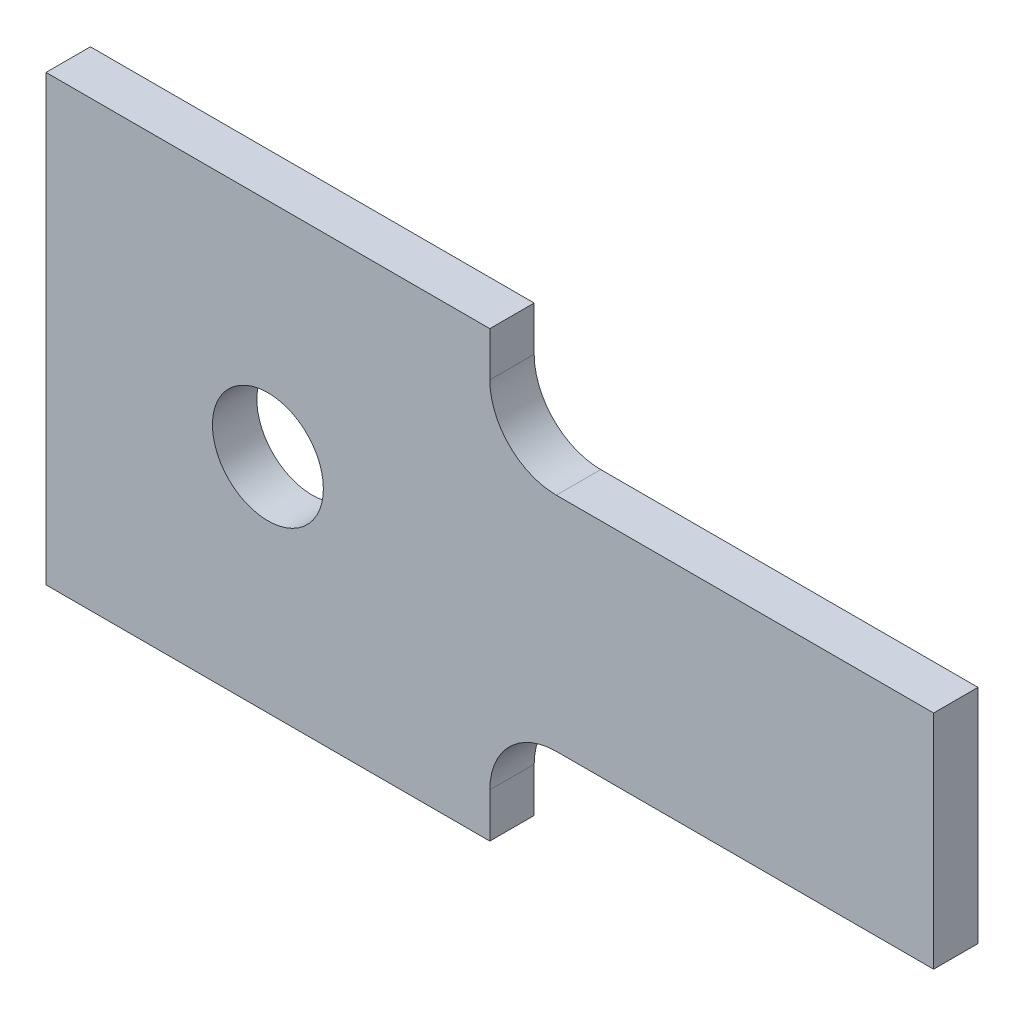
ISO-10303-21;
HEADER;
FILE_DESCRIPTION(('STEP AP214'),'2;1');
FILE_NAME('part.step','',(''),(''),'','','');
FILE_SCHEMA(('AUTOMOTIVE_DESIGN { 1 0 10303 214 1 1 1 1 }'));
ENDSEC;
DATA;
#1=APPLICATION_CONTEXT('core data for automotive mechanical design processes');
#2=APPLICATION_PROTOCOL_DEFINITION('international standard','automotive_design',2000,#1);
#3=PRODUCT_CONTEXT('',#1,'mechanical');
#4=PRODUCT('Part','Part','',(#3));
#5=PRODUCT_RELATED_PRODUCT_CATEGORY('part','',(#4));
#6=PRODUCT_DEFINITION_FORMATION('','',#4);
#7=PRODUCT_DEFINITION_CONTEXT('part definition',#1,'design');
#8=PRODUCT_DEFINITION('design','',#6,#7);
#9=PRODUCT_DEFINITION_SHAPE('','',#8);
#10=(LENGTH_UNIT() NAMED_UNIT(*) SI_UNIT(.MILLI.,.METRE.));
#11=(NAMED_UNIT(*) PLANE_ANGLE_UNIT() SI_UNIT($,.RADIAN.));
#12=(NAMED_UNIT(*) SI_UNIT($,.STERADIAN.) SOLID_ANGLE_UNIT());
#13=UNCERTAINTY_MEASURE_WITH_UNIT(LENGTH_MEASURE(1.E-05),#10,'distance_accuracy_value','');
#14=(GEOMETRIC_REPRESENTATION_CONTEXT(3) GLOBAL_UNCERTAINTY_ASSIGNED_CONTEXT((#13)) GLOBAL_UNIT_ASSIGNED_CONTEXT((#10,
#11,#12)) REPRESENTATION_CONTEXT('',''));
#15=CARTESIAN_POINT('',(0.,0.,0.));
#16=DIRECTION('',(0.,0.,1.));
#17=DIRECTION('',(1.,0.,0.));
#18=AXIS2_PLACEMENT_3D('',#15,#16,#17);
#19=CARTESIAN_POINT('',(0.,50.,10.));
#20=DIRECTION('',(1.,0.,0.));
#21=DIRECTION('',(0.,0.,-1.));
#22=AXIS2_PLACEMENT_3D('',#19,#20,#21);
#23=PLANE('',#22);
#24=DIRECTION('',(0.,-1.,0.));
#25=VECTOR('',#24,1.);
#26=CARTESIAN_POINT('',(0.,50.,5.));
#27=LINE('',#26,#25);
#28=CARTESIAN_POINT('',(0.,0.,5.));
#29=VERTEX_POINT('',#28);
#30=CARTESIAN_POINT('',(0.,-50.,5.));
#31=VERTEX_POINT('',#30);
#32=EDGE_CURVE('E11',#29,#31,#27,.T.);
#33=ORIENTED_EDGE('',*,*,#32,.F.);
#34=DIRECTION('',(0.,0.,1.));
#35=VECTOR('',#34,1.);
#36=CARTESIAN_POINT('',(0.,0.,10.));
#37=LINE('',#36,#35);
#38=CARTESIAN_POINT('',(0.,0.,0.));
#39=VERTEX_POINT('',#38);
#40=EDGE_CURVE('E157',#39,#29,#37,.T.);
#41=ORIENTED_EDGE('',*,*,#40,.F.);
#42=DIRECTION('',(0.,-1.,0.));
#43=VECTOR('',#42,1.);
#44=CARTESIAN_POINT('',(0.,50.,0.));
#45=LINE('',#44,#43);
#46=CARTESIAN_POINT('',(0.,-50.,0.));
#47=VERTEX_POINT('',#46);
#48=EDGE_CURVE('E191',#39,#47,#45,.T.);
#49=ORIENTED_EDGE('',*,*,#48,.T.);
#50=DIRECTION('',(0.,0.,-1.));
#51=VECTOR('',#50,1.);
#52=CARTESIAN_POINT('',(0.,-50.,10.));
#53=LINE('',#52,#51);
#54=EDGE_CURVE('E230',#31,#47,#53,.T.);
#55=ORIENTED_EDGE('',*,*,#54,.F.);
#56=EDGE_LOOP('',(#33,#41,#49,#55));
#57=FACE_BOUND('',#56,.T.);
#58=ADVANCED_FACE('F40',(#57),#23,.F.);
#59=DIRECTION('',(0.,-1.,0.));
#60=VECTOR('',#59,1.);
#61=CARTESIAN_POINT('',(0.,50.,5.));
#62=LINE('',#61,#60);
#63=CARTESIAN_POINT('',(0.,50.,5.));
#64=VERTEX_POINT('',#63);
#65=EDGE_CURVE('E44',#64,#29,#62,.T.);
#66=ORIENTED_EDGE('',*,*,#65,.F.);
#67=DIRECTION('',(0.,0.,-1.));
#68=VECTOR('',#67,1.);
#69=CARTESIAN_POINT('',(0.,50.,10.));
#70=LINE('',#69,#68);
#71=CARTESIAN_POINT('',(0.,50.,0.));
#72=VERTEX_POINT('',#71);
#73=EDGE_CURVE('E154',#64,#72,#70,.T.);
#74=ORIENTED_EDGE('',*,*,#73,.T.);
#75=EDGE_CURVE('E193',#72,#39,#45,.T.);
#76=ORIENTED_EDGE('',*,*,#75,.T.);
#77=ORIENTED_EDGE('',*,*,#40,.T.);
#78=EDGE_LOOP('',(#66,#74,#76,#77));
#79=FACE_BOUND('',#78,.T.);
#80=ADVANCED_FACE('F274',(#79),#23,.F.);
#81=CARTESIAN_POINT('',(0.,0.,10.));
#82=VERTEX_POINT('',#81);
#83=EDGE_CURVE('E137',#29,#82,#37,.T.);
#84=ORIENTED_EDGE('',*,*,#83,.F.);
#85=ORIENTED_EDGE('',*,*,#32,.T.);
#86=CARTESIAN_POINT('',(0.,-50.,10.));
#87=VERTEX_POINT('',#86);
#88=EDGE_CURVE('E159',#87,#31,#53,.T.);
#89=ORIENTED_EDGE('',*,*,#88,.F.);
#90=DIRECTION('',(0.,-1.,0.));
#91=VECTOR('',#90,1.);
#92=CARTESIAN_POINT('',(0.,50.,10.));
#93=LINE('',#92,#91);
#94=EDGE_CURVE('E141',#82,#87,#93,.T.);
#95=ORIENTED_EDGE('',*,*,#94,.F.);
#96=EDGE_LOOP('',(#84,#85,#89,#95));
#97=FACE_BOUND('',#96,.T.);
#98=ADVANCED_FACE('F169',(#97),#23,.F.);
#99=CARTESIAN_POINT('',(100.,50.,10.));
#100=DIRECTION('',(0.,-1.,0.));
#101=DIRECTION('',(1.,0.,0.));
#102=AXIS2_PLACEMENT_3D('',#99,#100,#101);
#103=PLANE('',#102);
#104=DIRECTION('',(-1.,0.,0.));
#105=VECTOR('',#104,1.);
#106=CARTESIAN_POINT('',(100.,50.,0.));
#107=LINE('',#106,#105);
#108=CARTESIAN_POINT('',(100.,50.,0.));
#109=VERTEX_POINT('',#108);
#110=EDGE_CURVE('E189',#109,#72,#107,.T.);
#111=ORIENTED_EDGE('',*,*,#110,.T.);
#112=ORIENTED_EDGE('',*,*,#73,.F.);
#113=CARTESIAN_POINT('',(0.,50.,10.));
#114=VERTEX_POINT('',#113);
#115=EDGE_CURVE('E136',#114,#64,#70,.T.);
#116=ORIENTED_EDGE('',*,*,#115,.F.);
#117=DIRECTION('',(-1.,0.,0.));
#118=VECTOR('',#117,1.);
#119=CARTESIAN_POINT('',(100.,50.,10.));
#120=LINE('',#119,#118);
#121=CARTESIAN_POINT('',(100.,50.,10.));
#122=VERTEX_POINT('',#121);
#123=EDGE_CURVE('E144',#122,#114,#120,.T.);
#124=ORIENTED_EDGE('',*,*,#123,.F.);
#125=DIRECTION('',(0.,0.,-1.));
#126=VECTOR('',#125,1.);
#127=CARTESIAN_POINT('',(100.,50.,10.));
#128=LINE('',#127,#126);
#129=EDGE_CURVE('E188',#122,#109,#128,.T.);
#130=ORIENTED_EDGE('',*,*,#129,.T.);
#131=EDGE_LOOP('',(#111,#112,#116,#124,#130));
#132=FACE_BOUND('',#131,.T.);
#133=ADVANCED_FACE('F42',(#132),#103,.F.);
#134=ORIENTED_EDGE('',*,*,#115,.T.);
#135=ORIENTED_EDGE('',*,*,#65,.T.);
#136=ORIENTED_EDGE('',*,*,#83,.T.);
#137=EDGE_CURVE('E132',#114,#82,#93,.T.);
#138=ORIENTED_EDGE('',*,*,#137,.F.);
#139=EDGE_LOOP('',(#134,#135,#136,#138));
#140=FACE_BOUND('',#139,.T.);
#141=ADVANCED_FACE('F134',(#140),#23,.F.);
#142=CARTESIAN_POINT('',(100.,-50.,10.));
#143=DIRECTION('',(0.,1.,0.));
#144=DIRECTION('',(-1.,0.,0.));
#145=AXIS2_PLACEMENT_3D('',#142,#143,#144);
#146=PLANE('',#145);
#147=DIRECTION('',(1.,0.,0.));
#148=VECTOR('',#147,1.);
#149=CARTESIAN_POINT('',(100.,-50.,0.));
#150=LINE('',#149,#148);
#151=CARTESIAN_POINT('',(100.,-50.,0.));
#152=VERTEX_POINT('',#151);
#153=EDGE_CURVE('E195',#47,#152,#150,.T.);
#154=ORIENTED_EDGE('',*,*,#153,.T.);
#155=DIRECTION('',(0.,0.,-1.));
#156=VECTOR('',#155,1.);
#157=CARTESIAN_POINT('',(100.,-50.,10.));
#158=LINE('',#157,#156);
#159=CARTESIAN_POINT('',(100.,-50.,10.));
#160=VERTEX_POINT('',#159);
#161=EDGE_CURVE('E228',#160,#152,#158,.T.);
#162=ORIENTED_EDGE('',*,*,#161,.F.);
#163=DIRECTION('',(1.,0.,0.));
#164=VECTOR('',#163,1.);
#165=CARTESIAN_POINT('',(100.,-50.,10.));
#166=LINE('',#165,#164);
#167=EDGE_CURVE('E140',#87,#160,#166,.T.);
#168=ORIENTED_EDGE('',*,*,#167,.F.);
#169=ORIENTED_EDGE('',*,*,#88,.T.);
#170=ORIENTED_EDGE('',*,*,#54,.T.);
#171=EDGE_LOOP('',(#154,#162,#168,#169,#170));
#172=FACE_BOUND('',#171,.T.);
#173=ADVANCED_FACE('F237',(#172),#146,.F.);
#174=CARTESIAN_POINT('',(100.,-40.0000000000001,10.));
#175=DIRECTION('',(-1.,0.,0.));
#176=DIRECTION('',(0.,0.,1.));
#177=AXIS2_PLACEMENT_3D('',#174,#175,#176);
#178=PLANE('',#177);
#179=DIRECTION('',(0.,1.,0.));
#180=VECTOR('',#179,1.);
#181=CARTESIAN_POINT('',(100.,-40.0000000000001,0.));
#182=LINE('',#181,#180);
#183=CARTESIAN_POINT('',(100.,-40.0000000000001,0.));
#184=VERTEX_POINT('',#183);
#185=EDGE_CURVE('E197',#152,#184,#182,.T.);
#186=ORIENTED_EDGE('',*,*,#185,.T.);
#187=DIRECTION('',(0.,0.,-1.));
#188=VECTOR('',#187,1.);
#189=CARTESIAN_POINT('',(100.,-40.0000000000001,10.));
#190=LINE('',#189,#188);
#191=CARTESIAN_POINT('',(100.,-40.0000000000001,10.));
#192=VERTEX_POINT('',#191);
#193=EDGE_CURVE('E226',#192,#184,#190,.T.);
#194=ORIENTED_EDGE('',*,*,#193,.F.);
#195=DIRECTION('',(0.,1.,0.));
#196=VECTOR('',#195,1.);
#197=CARTESIAN_POINT('',(100.,-40.0000000000001,10.));
#198=LINE('',#197,#196);
#199=EDGE_CURVE('E175',#160,#192,#198,.T.);
#200=ORIENTED_EDGE('',*,*,#199,.F.);
#201=ORIENTED_EDGE('',*,*,#161,.T.);
#202=EDGE_LOOP('',(#186,#194,#200,#201));
#203=FACE_BOUND('',#202,.T.);
#204=ADVANCED_FACE('F241',(#203),#178,.F.);
#205=CARTESIAN_POINT('',(115.,-40.,10.));
#206=DIRECTION('',(0.,0.,-1.));
#207=DIRECTION('',(-1.,0.,0.));
#208=AXIS2_PLACEMENT_3D('',#205,#206,#207);
#209=CYLINDRICAL_SURFACE('',#208,15.);
#210=CARTESIAN_POINT('',(115.,-40.,0.));
#211=DIRECTION('',(0.,0.,-1.));
#212=DIRECTION('',(1.,0.,0.));
#213=AXIS2_PLACEMENT_3D('',#210,#211,#212);
#214=CIRCLE('',#213,15.);
#215=CARTESIAN_POINT('',(115.,-25.,0.));
#216=VERTEX_POINT('',#215);
#217=EDGE_CURVE('E199',#184,#216,#214,.T.);
#218=ORIENTED_EDGE('',*,*,#217,.T.);
#219=DIRECTION('',(0.,0.,-1.));
#220=VECTOR('',#219,1.);
#221=CARTESIAN_POINT('',(115.,-25.,10.));
#222=LINE('',#221,#220);
#223=CARTESIAN_POINT('',(115.,-25.,10.));
#224=VERTEX_POINT('',#223);
#225=EDGE_CURVE('E223',#224,#216,#222,.T.);
#226=ORIENTED_EDGE('',*,*,#225,.F.);
#227=CARTESIAN_POINT('',(115.,-40.,10.));
#228=DIRECTION('',(0.,0.,-1.));
#229=DIRECTION('',(1.,0.,0.));
#230=AXIS2_PLACEMENT_3D('',#227,#228,#229);
#231=CIRCLE('',#230,15.);
#232=EDGE_CURVE('E177',#192,#224,#231,.T.);
#233=ORIENTED_EDGE('',*,*,#232,.F.);
#234=ORIENTED_EDGE('',*,*,#193,.T.);
#235=EDGE_LOOP('',(#218,#226,#233,#234));
#236=FACE_BOUND('',#235,.T.);
#237=ADVANCED_FACE('F244',(#236),#209,.F.);
#238=CARTESIAN_POINT('',(200.,-25.,10.));
#239=DIRECTION('',(0.,1.,0.));
#240=DIRECTION('',(-1.,0.,0.));
#241=AXIS2_PLACEMENT_3D('',#238,#239,#240);
#242=PLANE('',#241);
#243=DIRECTION('',(1.,0.,0.));
#244=VECTOR('',#243,1.);
#245=CARTESIAN_POINT('',(200.,-25.,0.));
#246=LINE('',#245,#244);
#247=CARTESIAN_POINT('',(200.,-25.,0.));
#248=VERTEX_POINT('',#247);
#249=EDGE_CURVE('E201',#216,#248,#246,.T.);
#250=ORIENTED_EDGE('',*,*,#249,.T.);
#251=DIRECTION('',(0.,0.,-1.));
#252=VECTOR('',#251,1.);
#253=CARTESIAN_POINT('',(200.,-25.,10.));
#254=LINE('',#253,#252);
#255=CARTESIAN_POINT('',(200.,-25.,10.));
#256=VERTEX_POINT('',#255);
#257=EDGE_CURVE('E220',#256,#248,#254,.T.);
#258=ORIENTED_EDGE('',*,*,#257,.F.);
#259=DIRECTION('',(1.,0.,0.));
#260=VECTOR('',#259,1.);
#261=CARTESIAN_POINT('',(200.,-25.,10.));
#262=LINE('',#261,#260);
#263=EDGE_CURVE('E179',#224,#256,#262,.T.);
#264=ORIENTED_EDGE('',*,*,#263,.F.);
#265=ORIENTED_EDGE('',*,*,#225,.T.);
#266=EDGE_LOOP('',(#250,#258,#264,#265));
#267=FACE_BOUND('',#266,.T.);
#268=ADVANCED_FACE('F249',(#267),#242,.F.);
#269=CARTESIAN_POINT('',(200.,-25.,10.));
#270=DIRECTION('',(-1.,0.,0.));
#271=DIRECTION('',(0.,0.,1.));
#272=AXIS2_PLACEMENT_3D('',#269,#270,#271);
#273=PLANE('',#272);
#274=DIRECTION('',(0.,1.,0.));
#275=VECTOR('',#274,1.);
#276=CARTESIAN_POINT('',(200.,-25.,0.));
#277=LINE('',#276,#275);
#278=CARTESIAN_POINT('',(200.,25.,0.));
#279=VERTEX_POINT('',#278);
#280=EDGE_CURVE('E203',#248,#279,#277,.T.);
#281=ORIENTED_EDGE('',*,*,#280,.T.);
#282=DIRECTION('',(0.,0.,-1.));
#283=VECTOR('',#282,1.);
#284=CARTESIAN_POINT('',(200.,25.,10.));
#285=LINE('',#284,#283);
#286=CARTESIAN_POINT('',(200.,25.,10.));
#287=VERTEX_POINT('',#286);
#288=EDGE_CURVE('E217',#287,#279,#285,.T.);
#289=ORIENTED_EDGE('',*,*,#288,.F.);
#290=DIRECTION('',(0.,1.,0.));
#291=VECTOR('',#290,1.);
#292=CARTESIAN_POINT('',(200.,-25.,10.));
#293=LINE('',#292,#291);
#294=EDGE_CURVE('E181',#256,#287,#293,.T.);
#295=ORIENTED_EDGE('',*,*,#294,.F.);
#296=ORIENTED_EDGE('',*,*,#257,.T.);
#297=EDGE_LOOP('',(#281,#289,#295,#296));
#298=FACE_BOUND('',#297,.T.);
#299=ADVANCED_FACE('F255',(#298),#273,.F.);
#300=CARTESIAN_POINT('',(200.,25.,10.));
#301=DIRECTION('',(0.,-1.,0.));
#302=DIRECTION('',(1.,0.,0.));
#303=AXIS2_PLACEMENT_3D('',#300,#301,#302);
#304=PLANE('',#303);
#305=DIRECTION('',(-1.,0.,0.));
#306=VECTOR('',#305,1.);
#307=CARTESIAN_POINT('',(200.,25.,0.));
#308=LINE('',#307,#306);
#309=CARTESIAN_POINT('',(115.,25.,0.));
#310=VERTEX_POINT('',#309);
#311=EDGE_CURVE('E205',#279,#310,#308,.T.);
#312=ORIENTED_EDGE('',*,*,#311,.T.);
#313=DIRECTION('',(0.,0.,-1.));
#314=VECTOR('',#313,1.);
#315=CARTESIAN_POINT('',(115.,25.,10.));
#316=LINE('',#315,#314);
#317=CARTESIAN_POINT('',(115.,25.,10.));
#318=VERTEX_POINT('',#317);
#319=EDGE_CURVE('E214',#318,#310,#316,.T.);
#320=ORIENTED_EDGE('',*,*,#319,.F.);
#321=DIRECTION('',(-1.,0.,0.));
#322=VECTOR('',#321,1.);
#323=CARTESIAN_POINT('',(200.,25.,10.));
#324=LINE('',#323,#322);
#325=EDGE_CURVE('E183',#287,#318,#324,.T.);
#326=ORIENTED_EDGE('',*,*,#325,.F.);
#327=ORIENTED_EDGE('',*,*,#288,.T.);
#328=EDGE_LOOP('',(#312,#320,#326,#327));
#329=FACE_BOUND('',#328,.T.);
#330=ADVANCED_FACE('F259',(#329),#304,.F.);
#331=CARTESIAN_POINT('',(115.,40.,10.));
#332=DIRECTION('',(0.,0.,-1.));
#333=DIRECTION('',(-1.,0.,0.));
#334=AXIS2_PLACEMENT_3D('',#331,#332,#333);
#335=CYLINDRICAL_SURFACE('',#334,15.);
#336=CARTESIAN_POINT('',(115.,40.,0.));
#337=DIRECTION('',(0.,0.,-1.));
#338=DIRECTION('',(-1.,0.,0.));
#339=AXIS2_PLACEMENT_3D('',#336,#337,#338);
#340=CIRCLE('',#339,15.);
#341=CARTESIAN_POINT('',(100.,40.0000000000001,0.));
#342=VERTEX_POINT('',#341);
#343=EDGE_CURVE('E207',#310,#342,#340,.T.);
#344=ORIENTED_EDGE('',*,*,#343,.T.);
#345=DIRECTION('',(0.,0.,-1.));
#346=VECTOR('',#345,1.);
#347=CARTESIAN_POINT('',(100.,40.0000000000001,10.));
#348=LINE('',#347,#346);
#349=CARTESIAN_POINT('',(100.,40.0000000000001,10.));
#350=VERTEX_POINT('',#349);
#351=EDGE_CURVE('E211',#350,#342,#348,.T.);
#352=ORIENTED_EDGE('',*,*,#351,.F.);
#353=CARTESIAN_POINT('',(115.,40.,10.));
#354=DIRECTION('',(0.,0.,-1.));
#355=DIRECTION('',(-1.,0.,0.));
#356=AXIS2_PLACEMENT_3D('',#353,#354,#355);
#357=CIRCLE('',#356,15.);
#358=EDGE_CURVE('E185',#318,#350,#357,.T.);
#359=ORIENTED_EDGE('',*,*,#358,.F.);
#360=ORIENTED_EDGE('',*,*,#319,.T.);
#361=EDGE_LOOP('',(#344,#352,#359,#360));
#362=FACE_BOUND('',#361,.T.);
#363=ADVANCED_FACE('F264',(#362),#335,.F.);
#364=CARTESIAN_POINT('',(100.,40.0000000000001,10.));
#365=DIRECTION('',(-1.,0.,0.));
#366=DIRECTION('',(0.,0.,1.));
#367=AXIS2_PLACEMENT_3D('',#364,#365,#366);
#368=PLANE('',#367);
#369=DIRECTION('',(0.,1.,0.));
#370=VECTOR('',#369,1.);
#371=CARTESIAN_POINT('',(100.,40.0000000000001,0.));
#372=LINE('',#371,#370);
#373=EDGE_CURVE('E151',#342,#109,#372,.T.);
#374=ORIENTED_EDGE('',*,*,#373,.T.);
#375=ORIENTED_EDGE('',*,*,#129,.F.);
#376=DIRECTION('',(0.,1.,0.));
#377=VECTOR('',#376,1.);
#378=CARTESIAN_POINT('',(100.,40.0000000000001,10.));
#379=LINE('',#378,#377);
#380=EDGE_CURVE('E147',#350,#122,#379,.T.);
#381=ORIENTED_EDGE('',*,*,#380,.F.);
#382=ORIENTED_EDGE('',*,*,#351,.T.);
#383=EDGE_LOOP('',(#374,#375,#381,#382));
#384=FACE_BOUND('',#383,.T.);
#385=ADVANCED_FACE('F267',(#384),#368,.F.);
#386=CARTESIAN_POINT('',(115.,-40.,10.));
#387=DIRECTION('',(0.,0.,1.));
#388=DIRECTION('',(1.,0.,0.));
#389=AXIS2_PLACEMENT_3D('',#386,#387,#388);
#390=PLANE('',#389);
#391=CARTESIAN_POINT('',(50.,0.,10.));
#392=DIRECTION('',(0.,0.,1.));
#393=DIRECTION('',(1.,0.,0.));
#394=AXIS2_PLACEMENT_3D('',#391,#392,#393);
#395=CIRCLE('',#394,12.5);
#396=CARTESIAN_POINT('',(62.5,0.,10.));
#397=VERTEX_POINT('',#396);
#398=EDGE_CURVE('E315',#397,#397,#395,.T.);
#399=ORIENTED_EDGE('',*,*,#398,.F.);
#400=EDGE_LOOP('',(#399));
#401=FACE_BOUND('',#400,.T.);
#402=ORIENTED_EDGE('',*,*,#123,.T.);
#403=ORIENTED_EDGE('',*,*,#137,.T.);
#404=ORIENTED_EDGE('',*,*,#94,.T.);
#405=ORIENTED_EDGE('',*,*,#167,.T.);
#406=ORIENTED_EDGE('',*,*,#199,.T.);
#407=ORIENTED_EDGE('',*,*,#232,.T.);
#408=ORIENTED_EDGE('',*,*,#263,.T.);
#409=ORIENTED_EDGE('',*,*,#294,.T.);
#410=ORIENTED_EDGE('',*,*,#325,.T.);
#411=ORIENTED_EDGE('',*,*,#358,.T.);
#412=ORIENTED_EDGE('',*,*,#380,.T.);
#413=EDGE_LOOP('',(#402,#403,#404,#405,#406,#407,#408,#409,#410,#411,#412));
#414=FACE_BOUND('',#413,.T.);
#415=ADVANCED_FACE('F145',(#401,#414),#390,.T.);
#416=CARTESIAN_POINT('',(115.,-40.,0.));
#417=DIRECTION('',(0.,0.,1.));
#418=DIRECTION('',(1.,0.,0.));
#419=AXIS2_PLACEMENT_3D('',#416,#417,#418);
#420=PLANE('',#419);
#421=CARTESIAN_POINT('',(50.,0.,0.));
#422=DIRECTION('',(0.,0.,1.));
#423=DIRECTION('',(1.,0.,0.));
#424=AXIS2_PLACEMENT_3D('',#421,#422,#423);
#425=CIRCLE('',#424,12.5);
#426=CARTESIAN_POINT('',(62.5,0.,0.));
#427=VERTEX_POINT('',#426);
#428=EDGE_CURVE('E192',#427,#427,#425,.T.);
#429=ORIENTED_EDGE('',*,*,#428,.T.);
#430=EDGE_LOOP('',(#429));
#431=FACE_BOUND('',#430,.T.);
#432=ORIENTED_EDGE('',*,*,#110,.F.);
#433=ORIENTED_EDGE('',*,*,#373,.F.);
#434=ORIENTED_EDGE('',*,*,#343,.F.);
#435=ORIENTED_EDGE('',*,*,#311,.F.);
#436=ORIENTED_EDGE('',*,*,#280,.F.);
#437=ORIENTED_EDGE('',*,*,#249,.F.);
#438=ORIENTED_EDGE('',*,*,#217,.F.);
#439=ORIENTED_EDGE('',*,*,#185,.F.);
#440=ORIENTED_EDGE('',*,*,#153,.F.);
#441=ORIENTED_EDGE('',*,*,#48,.F.);
#442=ORIENTED_EDGE('',*,*,#75,.F.);
#443=EDGE_LOOP('',(#432,#433,#434,#435,#436,#437,#438,#439,#440,#441,#442));
#444=FACE_BOUND('',#443,.T.);
#445=ADVANCED_FACE('F271',(#431,#444),#420,.F.);
#446=CARTESIAN_POINT('',(50.,0.,0.));
#447=DIRECTION('',(0.,0.,1.));
#448=DIRECTION('',(1.,0.,0.));
#449=AXIS2_PLACEMENT_3D('',#446,#447,#448);
#450=CYLINDRICAL_SURFACE('',#449,12.5);
#451=ORIENTED_EDGE('',*,*,#428,.F.);
#452=EDGE_LOOP('',(#451));
#453=FACE_BOUND('',#452,.T.);
#454=ORIENTED_EDGE('',*,*,#398,.T.);
#455=EDGE_LOOP('',(#454));
#456=FACE_BOUND('',#455,.T.);
#457=ADVANCED_FACE('F301',(#453,#456),#450,.F.);
#458=CLOSED_SHELL('',(#58,#80,#98,#133,#141,#173,#204,#237,#268,#299,#330,#363,#385,#415,#445,#457));
#459=MANIFOLD_SOLID_BREP('B2',#458);
#460=ADVANCED_BREP_SHAPE_REPRESENTATION('',(#18,#459),#14);
#461=SHAPE_DEFINITION_REPRESENTATION(#9,#460);
ENDSEC;
END-ISO-10303-21;
